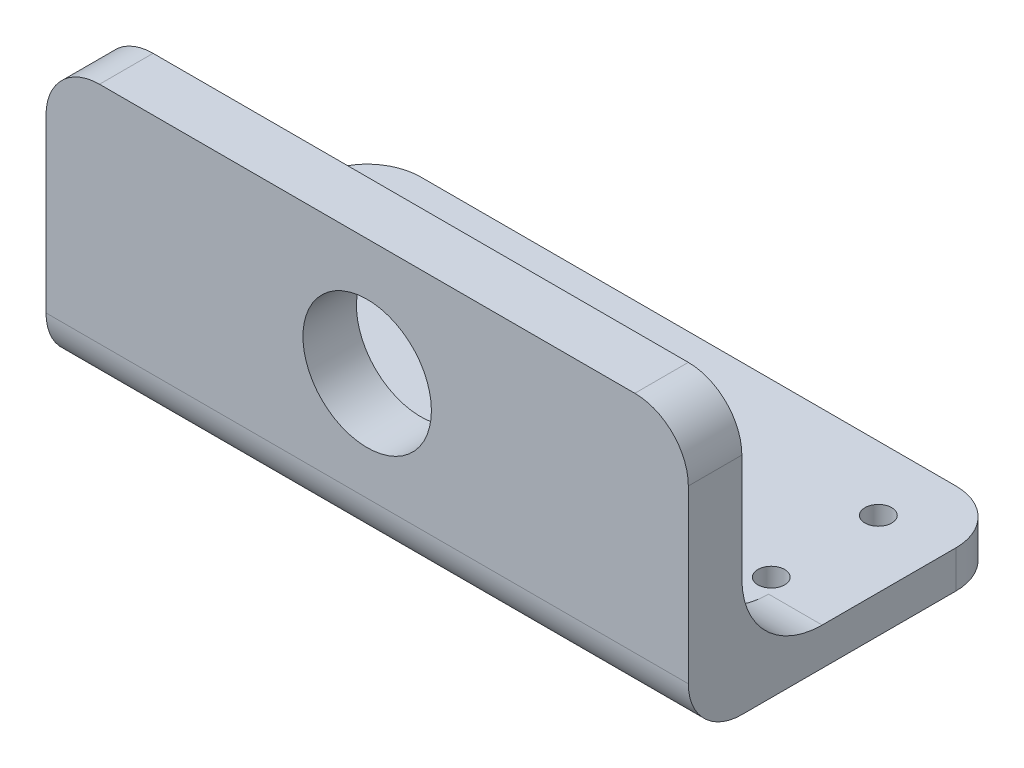
ISO-10303-21;
HEADER;
FILE_DESCRIPTION(('STEP AP214'),'2;1');
FILE_NAME('part.step','',(''),(''),'','','');
FILE_SCHEMA(('AUTOMOTIVE_DESIGN { 1 0 10303 214 1 1 1 1 }'));
ENDSEC;
DATA;
#1=APPLICATION_CONTEXT('core data for automotive mechanical design processes');
#2=APPLICATION_PROTOCOL_DEFINITION('international standard','automotive_design',2000,#1);
#3=PRODUCT_CONTEXT('',#1,'mechanical');
#4=PRODUCT('Part','Part','',(#3));
#5=PRODUCT_RELATED_PRODUCT_CATEGORY('part','',(#4));
#6=PRODUCT_DEFINITION_FORMATION('','',#4);
#7=PRODUCT_DEFINITION_CONTEXT('part definition',#1,'design');
#8=PRODUCT_DEFINITION('design','',#6,#7);
#9=PRODUCT_DEFINITION_SHAPE('','',#8);
#10=(LENGTH_UNIT() NAMED_UNIT(*) SI_UNIT(.MILLI.,.METRE.));
#11=(NAMED_UNIT(*) PLANE_ANGLE_UNIT() SI_UNIT($,.RADIAN.));
#12=(NAMED_UNIT(*) SI_UNIT($,.STERADIAN.) SOLID_ANGLE_UNIT());
#13=UNCERTAINTY_MEASURE_WITH_UNIT(LENGTH_MEASURE(1.E-05),#10,'distance_accuracy_value','');
#14=(GEOMETRIC_REPRESENTATION_CONTEXT(3) GLOBAL_UNCERTAINTY_ASSIGNED_CONTEXT((#13)) GLOBAL_UNIT_ASSIGNED_CONTEXT((#10,
#11,#12)) REPRESENTATION_CONTEXT('',''));
#15=CARTESIAN_POINT('',(0.,0.,0.));
#16=DIRECTION('',(0.,0.,1.));
#17=DIRECTION('',(1.,0.,0.));
#18=AXIS2_PLACEMENT_3D('',#15,#16,#17);
#19=CARTESIAN_POINT('',(60.,-72.,-2.5));
#20=DIRECTION('',(1.,0.,0.));
#21=DIRECTION('',(0.,0.,-1.));
#22=AXIS2_PLACEMENT_3D('',#19,#20,#21);
#23=PLANE('',#22);
#24=DIRECTION('',(0.,1.,0.));
#25=VECTOR('',#24,1.);
#26=CARTESIAN_POINT('',(60.,-72.,-2.5));
#27=LINE('',#26,#25);
#28=CARTESIAN_POINT('',(60.,-62.,-2.5));
#29=VERTEX_POINT('',#28);
#30=CARTESIAN_POINT('',(60.,-30.,-2.5));
#31=VERTEX_POINT('',#30);
#32=EDGE_CURVE('E194',#29,#31,#27,.T.);
#33=ORIENTED_EDGE('',*,*,#32,.F.);
#34=CARTESIAN_POINT('',(60.,-62.,-12.5));
#35=DIRECTION('',(1.,0.,0.));
#36=DIRECTION('',(0.,0.,-1.));
#37=AXIS2_PLACEMENT_3D('',#34,#35,#36);
#38=CIRCLE('',#37,10.);
#39=CARTESIAN_POINT('',(60.,-72.,-12.5));
#40=VERTEX_POINT('',#39);
#41=EDGE_CURVE('E64',#29,#40,#38,.T.);
#42=ORIENTED_EDGE('',*,*,#41,.T.);
#43=DIRECTION('',(0.,0.,-1.));
#44=VECTOR('',#43,1.);
#45=CARTESIAN_POINT('',(60.,-72.,-2.5));
#46=LINE('',#45,#44);
#47=CARTESIAN_POINT('',(60.,-72.,-52.5));
#48=VERTEX_POINT('',#47);
#49=EDGE_CURVE('E185',#40,#48,#46,.T.);
#50=ORIENTED_EDGE('',*,*,#49,.T.);
#51=DIRECTION('',(0.,1.,0.));
#52=VECTOR('',#51,1.);
#53=CARTESIAN_POINT('',(60.,-72.,-52.5));
#54=LINE('',#53,#52);
#55=CARTESIAN_POINT('',(60.,-65.,-52.5));
#56=VERTEX_POINT('',#55);
#57=EDGE_CURVE('E223',#48,#56,#54,.T.);
#58=ORIENTED_EDGE('',*,*,#57,.T.);
#59=DIRECTION('',(0.,0.,-1.));
#60=VECTOR('',#59,1.);
#61=CARTESIAN_POINT('',(60.,-65.,-27.5));
#62=LINE('',#61,#60);
#63=CARTESIAN_POINT('',(60.,-65.,-27.5));
#64=VERTEX_POINT('',#63);
#65=EDGE_CURVE('E280',#64,#56,#62,.T.);
#66=ORIENTED_EDGE('',*,*,#65,.F.);
#67=CARTESIAN_POINT('',(60.,-50.,-27.5));
#68=DIRECTION('',(1.,0.,0.));
#69=DIRECTION('',(0.,0.,-1.));
#70=AXIS2_PLACEMENT_3D('',#67,#68,#69);
#71=CIRCLE('',#70,15.);
#72=CARTESIAN_POINT('',(60.,-50.,-12.5));
#73=VERTEX_POINT('',#72);
#74=EDGE_CURVE('E277',#73,#64,#71,.T.);
#75=ORIENTED_EDGE('',*,*,#74,.F.);
#76=DIRECTION('',(0.,1.,0.));
#77=VECTOR('',#76,1.);
#78=CARTESIAN_POINT('',(60.,-50.,-12.5));
#79=LINE('',#78,#77);
#80=CARTESIAN_POINT('',(60.,-30.,-12.5));
#81=VERTEX_POINT('',#80);
#82=EDGE_CURVE('E177',#73,#81,#79,.T.);
#83=ORIENTED_EDGE('',*,*,#82,.T.);
#84=DIRECTION('',(0.,0.,-1.));
#85=VECTOR('',#84,1.);
#86=CARTESIAN_POINT('',(60.,-30.,-2.5));
#87=LINE('',#86,#85);
#88=EDGE_CURVE('E213',#81,#31,#87,.F.);
#89=ORIENTED_EDGE('',*,*,#88,.T.);
#90=EDGE_LOOP('',(#33,#42,#50,#58,#66,#75,#83,#89));
#91=FACE_BOUND('',#90,.T.);
#92=ADVANCED_FACE('F42',(#91),#23,.T.);
#93=CARTESIAN_POINT('',(-60.,-72.,-2.5));
#94=DIRECTION('',(0.,0.,1.));
#95=DIRECTION('',(1.,0.,0.));
#96=AXIS2_PLACEMENT_3D('',#93,#94,#95);
#97=PLANE('',#96);
#98=CARTESIAN_POINT('',(0.,-41.8,-2.5));
#99=DIRECTION('',(0.,0.,1.));
#100=DIRECTION('',(1.,0.,0.));
#101=AXIS2_PLACEMENT_3D('',#98,#99,#100);
#102=CIRCLE('',#101,12.);
#103=CARTESIAN_POINT('',(12.,-41.8,-2.5));
#104=VERTEX_POINT('',#103);
#105=EDGE_CURVE('E202',#104,#104,#102,.T.);
#106=ORIENTED_EDGE('',*,*,#105,.F.);
#107=EDGE_LOOP('',(#106));
#108=FACE_BOUND('',#107,.T.);
#109=DIRECTION('',(0.,1.,0.));
#110=VECTOR('',#109,1.);
#111=CARTESIAN_POINT('',(-60.,-72.,-2.5));
#112=LINE('',#111,#110);
#113=CARTESIAN_POINT('',(-60.,-62.,-2.5));
#114=VERTEX_POINT('',#113);
#115=CARTESIAN_POINT('',(-60.,-30.,-2.5));
#116=VERTEX_POINT('',#115);
#117=EDGE_CURVE('E193',#114,#116,#112,.T.);
#118=ORIENTED_EDGE('',*,*,#117,.F.);
#119=DIRECTION('',(1.,0.,0.));
#120=VECTOR('',#119,1.);
#121=CARTESIAN_POINT('',(60.,-62.,-2.5));
#122=LINE('',#121,#120);
#123=EDGE_CURVE('E242',#114,#29,#122,.T.);
#124=ORIENTED_EDGE('',*,*,#123,.T.);
#125=ORIENTED_EDGE('',*,*,#32,.T.);
#126=CARTESIAN_POINT('',(50.,-30.,-2.5));
#127=DIRECTION('',(0.,0.,1.));
#128=DIRECTION('',(1.,0.,0.));
#129=AXIS2_PLACEMENT_3D('',#126,#127,#128);
#130=CIRCLE('',#129,10.);
#131=CARTESIAN_POINT('',(50.,-20.,-2.5));
#132=VERTEX_POINT('',#131);
#133=EDGE_CURVE('E219',#31,#132,#130,.T.);
#134=ORIENTED_EDGE('',*,*,#133,.T.);
#135=DIRECTION('',(1.,0.,0.));
#136=VECTOR('',#135,1.);
#137=CARTESIAN_POINT('',(-60.,-20.,-2.5));
#138=LINE('',#137,#136);
#139=CARTESIAN_POINT('',(-50.,-20.,-2.5));
#140=VERTEX_POINT('',#139);
#141=EDGE_CURVE('E203',#140,#132,#138,.T.);
#142=ORIENTED_EDGE('',*,*,#141,.F.);
#143=CARTESIAN_POINT('',(-50.,-30.,-2.5));
#144=DIRECTION('',(0.,0.,1.));
#145=DIRECTION('',(1.,0.,0.));
#146=AXIS2_PLACEMENT_3D('',#143,#144,#145);
#147=CIRCLE('',#146,10.);
#148=EDGE_CURVE('E216',#140,#116,#147,.T.);
#149=ORIENTED_EDGE('',*,*,#148,.T.);
#150=EDGE_LOOP('',(#118,#124,#125,#134,#142,#149));
#151=FACE_BOUND('',#150,.T.);
#152=ADVANCED_FACE('F248',(#108,#151),#97,.T.);
#153=CARTESIAN_POINT('',(-60.,-72.,-62.5));
#154=DIRECTION('',(-1.,0.,0.));
#155=DIRECTION('',(0.,0.,1.));
#156=AXIS2_PLACEMENT_3D('',#153,#154,#155);
#157=PLANE('',#156);
#158=DIRECTION('',(0.,0.,1.));
#159=VECTOR('',#158,1.);
#160=CARTESIAN_POINT('',(-60.,-72.,-62.5));
#161=LINE('',#160,#159);
#162=CARTESIAN_POINT('',(-60.,-72.,-52.5));
#163=VERTEX_POINT('',#162);
#164=CARTESIAN_POINT('',(-60.,-72.,-12.5));
#165=VERTEX_POINT('',#164);
#166=EDGE_CURVE('E191',#163,#165,#161,.T.);
#167=ORIENTED_EDGE('',*,*,#166,.T.);
#168=CARTESIAN_POINT('',(-60.,-62.,-12.5));
#169=DIRECTION('',(-1.,0.,0.));
#170=DIRECTION('',(0.,0.,1.));
#171=AXIS2_PLACEMENT_3D('',#168,#169,#170);
#172=CIRCLE('',#171,10.);
#173=EDGE_CURVE('E11',#165,#114,#172,.T.);
#174=ORIENTED_EDGE('',*,*,#173,.T.);
#175=ORIENTED_EDGE('',*,*,#117,.T.);
#176=DIRECTION('',(0.,0.,1.));
#177=VECTOR('',#176,1.);
#178=CARTESIAN_POINT('',(-60.,-30.,-62.5));
#179=LINE('',#178,#177);
#180=CARTESIAN_POINT('',(-60.,-30.,-12.5));
#181=VERTEX_POINT('',#180);
#182=EDGE_CURVE('E221',#116,#181,#179,.F.);
#183=ORIENTED_EDGE('',*,*,#182,.T.);
#184=DIRECTION('',(0.,1.,0.));
#185=VECTOR('',#184,1.);
#186=CARTESIAN_POINT('',(-60.,-50.,-12.5));
#187=LINE('',#186,#185);
#188=CARTESIAN_POINT('',(-60.,-50.,-12.5));
#189=VERTEX_POINT('',#188);
#190=EDGE_CURVE('E174',#189,#181,#187,.T.);
#191=ORIENTED_EDGE('',*,*,#190,.F.);
#192=CARTESIAN_POINT('',(-60.,-50.,-27.5));
#193=DIRECTION('',(1.,0.,0.));
#194=DIRECTION('',(0.,0.,-1.));
#195=AXIS2_PLACEMENT_3D('',#192,#193,#194);
#196=CIRCLE('',#195,15.);
#197=CARTESIAN_POINT('',(-60.,-65.,-27.5));
#198=VERTEX_POINT('',#197);
#199=EDGE_CURVE('E173',#189,#198,#196,.T.);
#200=ORIENTED_EDGE('',*,*,#199,.T.);
#201=DIRECTION('',(0.,0.,-1.));
#202=VECTOR('',#201,1.);
#203=CARTESIAN_POINT('',(-60.,-65.,-27.5));
#204=LINE('',#203,#202);
#205=CARTESIAN_POINT('',(-60.,-65.,-52.5));
#206=VERTEX_POINT('',#205);
#207=EDGE_CURVE('E279',#198,#206,#204,.T.);
#208=ORIENTED_EDGE('',*,*,#207,.T.);
#209=DIRECTION('',(0.,1.,0.));
#210=VECTOR('',#209,1.);
#211=CARTESIAN_POINT('',(-60.,-72.,-52.5));
#212=LINE('',#211,#210);
#213=EDGE_CURVE('E240',#206,#163,#212,.F.);
#214=ORIENTED_EDGE('',*,*,#213,.T.);
#215=EDGE_LOOP('',(#167,#174,#175,#183,#191,#200,#208,#214));
#216=FACE_BOUND('',#215,.T.);
#217=ADVANCED_FACE('F309',(#216),#157,.T.);
#218=CARTESIAN_POINT('',(-60.,-50.,-12.5));
#219=DIRECTION('',(0.,0.,1.));
#220=DIRECTION('',(1.,0.,0.));
#221=AXIS2_PLACEMENT_3D('',#218,#219,#220);
#222=PLANE('',#221);
#223=CARTESIAN_POINT('',(0.,-41.8,-12.5));
#224=DIRECTION('',(0.,0.,1.));
#225=DIRECTION('',(1.,0.,0.));
#226=AXIS2_PLACEMENT_3D('',#223,#224,#225);
#227=CIRCLE('',#226,12.);
#228=CARTESIAN_POINT('',(12.,-41.8,-12.5));
#229=VERTEX_POINT('',#228);
#230=EDGE_CURVE('E199',#229,#229,#227,.T.);
#231=ORIENTED_EDGE('',*,*,#230,.T.);
#232=EDGE_LOOP('',(#231));
#233=FACE_BOUND('',#232,.T.);
#234=DIRECTION('',(-1.,0.,0.));
#235=VECTOR('',#234,1.);
#236=CARTESIAN_POINT('',(60.,-20.,-12.5));
#237=LINE('',#236,#235);
#238=CARTESIAN_POINT('',(50.,-20.,-12.5));
#239=VERTEX_POINT('',#238);
#240=CARTESIAN_POINT('',(-50.,-20.,-12.5));
#241=VERTEX_POINT('',#240);
#242=EDGE_CURVE('E264',#239,#241,#237,.T.);
#243=ORIENTED_EDGE('',*,*,#242,.F.);
#244=CARTESIAN_POINT('',(50.,-30.,-12.5));
#245=DIRECTION('',(0.,0.,1.));
#246=DIRECTION('',(1.,0.,0.));
#247=AXIS2_PLACEMENT_3D('',#244,#245,#246);
#248=CIRCLE('',#247,10.);
#249=EDGE_CURVE('E211',#239,#81,#248,.F.);
#250=ORIENTED_EDGE('',*,*,#249,.T.);
#251=ORIENTED_EDGE('',*,*,#82,.F.);
#252=DIRECTION('',(1.,0.,0.));
#253=VECTOR('',#252,1.);
#254=CARTESIAN_POINT('',(-60.,-50.,-12.5));
#255=LINE('',#254,#253);
#256=CARTESIAN_POINT('',(50.,-50.,-12.5));
#257=VERTEX_POINT('',#256);
#258=EDGE_CURVE('E175',#257,#73,#255,.T.);
#259=ORIENTED_EDGE('',*,*,#258,.F.);
#260=DIRECTION('',(0.,-1.,0.));
#261=VECTOR('',#260,1.);
#262=CARTESIAN_POINT('',(50.,-50.,-12.5));
#263=LINE('',#262,#261);
#264=CARTESIAN_POINT('',(50.,-65.,-12.5));
#265=VERTEX_POINT('',#264);
#266=EDGE_CURVE('E271',#257,#265,#263,.T.);
#267=ORIENTED_EDGE('',*,*,#266,.T.);
#268=DIRECTION('',(1.,0.,0.));
#269=VECTOR('',#268,1.);
#270=CARTESIAN_POINT('',(-50.,-65.,-12.5));
#271=LINE('',#270,#269);
#272=CARTESIAN_POINT('',(-50.,-65.,-12.5));
#273=VERTEX_POINT('',#272);
#274=EDGE_CURVE('E168',#273,#265,#271,.T.);
#275=ORIENTED_EDGE('',*,*,#274,.F.);
#276=DIRECTION('',(0.,-1.,0.));
#277=VECTOR('',#276,1.);
#278=CARTESIAN_POINT('',(-50.,-50.,-12.5));
#279=LINE('',#278,#277);
#280=CARTESIAN_POINT('',(-50.,-50.,-12.5));
#281=VERTEX_POINT('',#280);
#282=EDGE_CURVE('E151',#281,#273,#279,.T.);
#283=ORIENTED_EDGE('',*,*,#282,.F.);
#284=EDGE_CURVE('E165',#189,#281,#255,.T.);
#285=ORIENTED_EDGE('',*,*,#284,.F.);
#286=ORIENTED_EDGE('',*,*,#190,.T.);
#287=CARTESIAN_POINT('',(-50.,-30.,-12.5));
#288=DIRECTION('',(0.,0.,1.));
#289=DIRECTION('',(1.,0.,0.));
#290=AXIS2_PLACEMENT_3D('',#287,#288,#289);
#291=CIRCLE('',#290,10.);
#292=EDGE_CURVE('E209',#181,#241,#291,.F.);
#293=ORIENTED_EDGE('',*,*,#292,.T.);
#294=EDGE_LOOP('',(#243,#250,#251,#259,#267,#275,#283,#285,#286,#293));
#295=FACE_BOUND('',#294,.T.);
#296=ADVANCED_FACE('F163',(#233,#295),#222,.F.);
#297=CARTESIAN_POINT('',(-60.,-50.,-27.5));
#298=DIRECTION('',(1.,0.,0.));
#299=DIRECTION('',(0.,0.,-1.));
#300=AXIS2_PLACEMENT_3D('',#297,#298,#299);
#301=CYLINDRICAL_SURFACE('',#300,15.);
#302=CARTESIAN_POINT('',(-50.,-50.,-27.5));
#303=DIRECTION('',(1.,0.,0.));
#304=DIRECTION('',(0.,0.,-1.));
#305=AXIS2_PLACEMENT_3D('',#302,#303,#304);
#306=CIRCLE('',#305,15.);
#307=CARTESIAN_POINT('',(-50.,-65.,-27.5000000000001));
#308=VERTEX_POINT('',#307);
#309=EDGE_CURVE('E148',#308,#281,#306,.F.);
#310=ORIENTED_EDGE('',*,*,#309,.F.);
#311=DIRECTION('',(1.,0.,0.));
#312=VECTOR('',#311,1.);
#313=CARTESIAN_POINT('',(-60.,-65.,-27.5));
#314=LINE('',#313,#312);
#315=EDGE_CURVE('E182',#198,#308,#314,.T.);
#316=ORIENTED_EDGE('',*,*,#315,.F.);
#317=ORIENTED_EDGE('',*,*,#199,.F.);
#318=ORIENTED_EDGE('',*,*,#284,.T.);
#319=EDGE_LOOP('',(#310,#316,#317,#318));
#320=FACE_BOUND('',#319,.T.);
#321=ADVANCED_FACE('F171',(#320),#301,.F.);
#322=CARTESIAN_POINT('',(60.,-72.,-62.5));
#323=DIRECTION('',(0.,0.,-1.));
#324=DIRECTION('',(-1.,0.,0.));
#325=AXIS2_PLACEMENT_3D('',#322,#323,#324);
#326=PLANE('',#325);
#327=DIRECTION('',(1.,0.,0.));
#328=VECTOR('',#327,1.);
#329=CARTESIAN_POINT('',(-60.,-65.,-62.5));
#330=LINE('',#329,#328);
#331=CARTESIAN_POINT('',(-50.,-65.,-62.5));
#332=VERTEX_POINT('',#331);
#333=CARTESIAN_POINT('',(50.,-65.,-62.5));
#334=VERTEX_POINT('',#333);
#335=EDGE_CURVE('E179',#332,#334,#330,.T.);
#336=ORIENTED_EDGE('',*,*,#335,.T.);
#337=DIRECTION('',(0.,1.,0.));
#338=VECTOR('',#337,1.);
#339=CARTESIAN_POINT('',(50.,-72.,-62.5));
#340=LINE('',#339,#338);
#341=CARTESIAN_POINT('',(50.,-72.,-62.5));
#342=VERTEX_POINT('',#341);
#343=EDGE_CURVE('E233',#334,#342,#340,.F.);
#344=ORIENTED_EDGE('',*,*,#343,.T.);
#345=DIRECTION('',(-1.,0.,0.));
#346=VECTOR('',#345,1.);
#347=CARTESIAN_POINT('',(60.,-72.,-62.5));
#348=LINE('',#347,#346);
#349=CARTESIAN_POINT('',(-50.,-72.,-62.5));
#350=VERTEX_POINT('',#349);
#351=EDGE_CURVE('E188',#342,#350,#348,.T.);
#352=ORIENTED_EDGE('',*,*,#351,.T.);
#353=DIRECTION('',(0.,1.,0.));
#354=VECTOR('',#353,1.);
#355=CARTESIAN_POINT('',(-50.,-72.,-62.5));
#356=LINE('',#355,#354);
#357=EDGE_CURVE('E230',#350,#332,#356,.T.);
#358=ORIENTED_EDGE('',*,*,#357,.T.);
#359=EDGE_LOOP('',(#336,#344,#352,#358));
#360=FACE_BOUND('',#359,.T.);
#361=ADVANCED_FACE('F314',(#360),#326,.T.);
#362=CARTESIAN_POINT('',(0.,-72.,0.));
#363=DIRECTION('',(0.,1.,0.));
#364=DIRECTION('',(0.,0.,1.));
#365=AXIS2_PLACEMENT_3D('',#362,#363,#364);
#366=PLANE('',#365);
#367=CARTESIAN_POINT('',(47.5,-72.,-30.5));
#368=DIRECTION('',(0.,1.,0.));
#369=DIRECTION('',(0.,0.,1.));
#370=AXIS2_PLACEMENT_3D('',#367,#368,#369);
#371=CIRCLE('',#370,2.5);
#372=CARTESIAN_POINT('',(47.5,-72.,-28.));
#373=VERTEX_POINT('',#372);
#374=EDGE_CURVE('E266',#373,#373,#371,.T.);
#375=ORIENTED_EDGE('',*,*,#374,.T.);
#376=EDGE_LOOP('',(#375));
#377=FACE_BOUND('',#376,.T.);
#378=CARTESIAN_POINT('',(-47.5,-72.,-50.5));
#379=DIRECTION('',(0.,1.,0.));
#380=DIRECTION('',(0.,0.,1.));
#381=AXIS2_PLACEMENT_3D('',#378,#379,#380);
#382=CIRCLE('',#381,2.5);
#383=CARTESIAN_POINT('',(-47.5,-72.,-48.));
#384=VERTEX_POINT('',#383);
#385=EDGE_CURVE('E564',#384,#384,#382,.T.);
#386=ORIENTED_EDGE('',*,*,#385,.T.);
#387=EDGE_LOOP('',(#386));
#388=FACE_BOUND('',#387,.T.);
#389=CARTESIAN_POINT('',(-47.5,-72.,-30.5));
#390=DIRECTION('',(0.,1.,0.));
#391=DIRECTION('',(0.,0.,1.));
#392=AXIS2_PLACEMENT_3D('',#389,#390,#391);
#393=CIRCLE('',#392,2.5);
#394=CARTESIAN_POINT('',(-47.5,-72.,-28.));
#395=VERTEX_POINT('',#394);
#396=EDGE_CURVE('E566',#395,#395,#393,.T.);
#397=ORIENTED_EDGE('',*,*,#396,.T.);
#398=EDGE_LOOP('',(#397));
#399=FACE_BOUND('',#398,.T.);
#400=CARTESIAN_POINT('',(47.5,-72.,-50.5));
#401=DIRECTION('',(0.,1.,0.));
#402=DIRECTION('',(0.,0.,1.));
#403=AXIS2_PLACEMENT_3D('',#400,#401,#402);
#404=CIRCLE('',#403,2.5);
#405=CARTESIAN_POINT('',(47.5,-72.,-48.));
#406=VERTEX_POINT('',#405);
#407=EDGE_CURVE('E571',#406,#406,#404,.T.);
#408=ORIENTED_EDGE('',*,*,#407,.T.);
#409=EDGE_LOOP('',(#408));
#410=FACE_BOUND('',#409,.T.);
#411=ORIENTED_EDGE('',*,*,#49,.F.);
#412=DIRECTION('',(1.,0.,0.));
#413=VECTOR('',#412,1.);
#414=CARTESIAN_POINT('',(-60.,-72.,-12.5));
#415=LINE('',#414,#413);
#416=EDGE_CURVE('E50',#40,#165,#415,.F.);
#417=ORIENTED_EDGE('',*,*,#416,.T.);
#418=ORIENTED_EDGE('',*,*,#166,.F.);
#419=CARTESIAN_POINT('',(-50.,-72.,-52.5));
#420=DIRECTION('',(0.,1.,0.));
#421=DIRECTION('',(0.,0.,1.));
#422=AXIS2_PLACEMENT_3D('',#419,#420,#421);
#423=CIRCLE('',#422,10.);
#424=EDGE_CURVE('E235',#163,#350,#423,.F.);
#425=ORIENTED_EDGE('',*,*,#424,.T.);
#426=ORIENTED_EDGE('',*,*,#351,.F.);
#427=CARTESIAN_POINT('',(50.,-72.,-52.5));
#428=DIRECTION('',(0.,1.,0.));
#429=DIRECTION('',(0.,0.,1.));
#430=AXIS2_PLACEMENT_3D('',#427,#428,#429);
#431=CIRCLE('',#430,10.);
#432=EDGE_CURVE('E237',#342,#48,#431,.F.);
#433=ORIENTED_EDGE('',*,*,#432,.T.);
#434=EDGE_LOOP('',(#411,#417,#418,#425,#426,#433));
#435=FACE_BOUND('',#434,.T.);
#436=ADVANCED_FACE('F313',(#377,#388,#399,#410,#435),#366,.F.);
#437=CARTESIAN_POINT('',(50.,-65.,-27.5));
#438=VERTEX_POINT('',#437);
#439=EDGE_CURVE('E283',#438,#64,#314,.T.);
#440=ORIENTED_EDGE('',*,*,#439,.F.);
#441=CARTESIAN_POINT('',(50.,-50.,-27.5));
#442=DIRECTION('',(1.,0.,0.));
#443=DIRECTION('',(0.,0.,-1.));
#444=AXIS2_PLACEMENT_3D('',#441,#442,#443);
#445=CIRCLE('',#444,15.);
#446=EDGE_CURVE('E158',#438,#257,#445,.F.);
#447=ORIENTED_EDGE('',*,*,#446,.T.);
#448=ORIENTED_EDGE('',*,*,#258,.T.);
#449=ORIENTED_EDGE('',*,*,#74,.T.);
#450=EDGE_LOOP('',(#440,#447,#448,#449));
#451=FACE_BOUND('',#450,.T.);
#452=ADVANCED_FACE('F299',(#451),#301,.F.);
#453=CARTESIAN_POINT('',(-60.,-65.,-27.5));
#454=DIRECTION('',(0.,-1.,0.));
#455=DIRECTION('',(0.,0.,-1.));
#456=AXIS2_PLACEMENT_3D('',#453,#454,#455);
#457=PLANE('',#456);
#458=CARTESIAN_POINT('',(47.5,-65.,-30.5));
#459=DIRECTION('',(0.,1.,0.));
#460=DIRECTION('',(0.,0.,1.));
#461=AXIS2_PLACEMENT_3D('',#458,#459,#460);
#462=CIRCLE('',#461,2.5);
#463=CARTESIAN_POINT('',(47.5,-65.,-28.));
#464=VERTEX_POINT('',#463);
#465=EDGE_CURVE('E561',#464,#464,#462,.T.);
#466=ORIENTED_EDGE('',*,*,#465,.F.);
#467=EDGE_LOOP('',(#466));
#468=FACE_BOUND('',#467,.T.);
#469=CARTESIAN_POINT('',(-47.5,-65.,-50.5));
#470=DIRECTION('',(0.,1.,0.));
#471=DIRECTION('',(0.,0.,-1.));
#472=AXIS2_PLACEMENT_3D('',#469,#470,#471);
#473=CIRCLE('',#472,2.5);
#474=CARTESIAN_POINT('',(-47.5,-65.,-53.));
#475=VERTEX_POINT('',#474);
#476=EDGE_CURVE('E577',#475,#475,#473,.T.);
#477=ORIENTED_EDGE('',*,*,#476,.F.);
#478=EDGE_LOOP('',(#477));
#479=FACE_BOUND('',#478,.T.);
#480=CARTESIAN_POINT('',(-47.5,-65.,-30.5));
#481=DIRECTION('',(0.,1.,0.));
#482=DIRECTION('',(0.,0.,-1.));
#483=AXIS2_PLACEMENT_3D('',#480,#481,#482);
#484=CIRCLE('',#483,2.5);
#485=CARTESIAN_POINT('',(-47.5,-65.,-33.));
#486=VERTEX_POINT('',#485);
#487=EDGE_CURVE('E580',#486,#486,#484,.T.);
#488=ORIENTED_EDGE('',*,*,#487,.F.);
#489=EDGE_LOOP('',(#488));
#490=FACE_BOUND('',#489,.T.);
#491=CARTESIAN_POINT('',(47.5,-65.,-50.5));
#492=DIRECTION('',(0.,1.,0.));
#493=DIRECTION('',(0.,0.,1.));
#494=AXIS2_PLACEMENT_3D('',#491,#492,#493);
#495=CIRCLE('',#494,2.5);
#496=CARTESIAN_POINT('',(47.5,-65.,-48.));
#497=VERTEX_POINT('',#496);
#498=EDGE_CURVE('E574',#497,#497,#495,.T.);
#499=ORIENTED_EDGE('',*,*,#498,.F.);
#500=EDGE_LOOP('',(#499));
#501=FACE_BOUND('',#500,.T.);
#502=ORIENTED_EDGE('',*,*,#65,.T.);
#503=CARTESIAN_POINT('',(50.,-65.,-52.5));
#504=DIRECTION('',(0.,-1.,0.));
#505=DIRECTION('',(0.,0.,-1.));
#506=AXIS2_PLACEMENT_3D('',#503,#504,#505);
#507=CIRCLE('',#506,10.);
#508=EDGE_CURVE('E228',#56,#334,#507,.F.);
#509=ORIENTED_EDGE('',*,*,#508,.T.);
#510=ORIENTED_EDGE('',*,*,#335,.F.);
#511=CARTESIAN_POINT('',(-50.,-65.,-52.5));
#512=DIRECTION('',(0.,-1.,0.));
#513=DIRECTION('',(0.,0.,-1.));
#514=AXIS2_PLACEMENT_3D('',#511,#512,#513);
#515=CIRCLE('',#514,10.);
#516=EDGE_CURVE('E226',#332,#206,#515,.F.);
#517=ORIENTED_EDGE('',*,*,#516,.T.);
#518=ORIENTED_EDGE('',*,*,#207,.F.);
#519=ORIENTED_EDGE('',*,*,#315,.T.);
#520=DIRECTION('',(0.,0.,-1.));
#521=VECTOR('',#520,1.);
#522=CARTESIAN_POINT('',(-50.,-65.,-12.5));
#523=LINE('',#522,#521);
#524=EDGE_CURVE('E153',#273,#308,#523,.T.);
#525=ORIENTED_EDGE('',*,*,#524,.F.);
#526=ORIENTED_EDGE('',*,*,#274,.T.);
#527=DIRECTION('',(0.,0.,-1.));
#528=VECTOR('',#527,1.);
#529=CARTESIAN_POINT('',(50.,-65.,-12.5));
#530=LINE('',#529,#528);
#531=EDGE_CURVE('E169',#265,#438,#530,.T.);
#532=ORIENTED_EDGE('',*,*,#531,.T.);
#533=ORIENTED_EDGE('',*,*,#439,.T.);
#534=EDGE_LOOP('',(#502,#509,#510,#517,#518,#519,#525,#526,#532,#533));
#535=FACE_BOUND('',#534,.T.);
#536=ADVANCED_FACE('F294',(#468,#479,#490,#501,#535),#457,.F.);
#537=CARTESIAN_POINT('',(-50.,0.,0.));
#538=DIRECTION('',(1.,0.,0.));
#539=DIRECTION('',(0.,0.,-1.));
#540=AXIS2_PLACEMENT_3D('',#537,#538,#539);
#541=PLANE('',#540);
#542=ORIENTED_EDGE('',*,*,#309,.T.);
#543=ORIENTED_EDGE('',*,*,#282,.T.);
#544=ORIENTED_EDGE('',*,*,#524,.T.);
#545=EDGE_LOOP('',(#542,#543,#544));
#546=FACE_BOUND('',#545,.T.);
#547=ADVANCED_FACE('F150',(#546),#541,.T.);
#548=CARTESIAN_POINT('',(50.,0.,0.));
#549=DIRECTION('',(1.,0.,0.));
#550=DIRECTION('',(0.,0.,-1.));
#551=AXIS2_PLACEMENT_3D('',#548,#549,#550);
#552=PLANE('',#551);
#553=ORIENTED_EDGE('',*,*,#531,.F.);
#554=ORIENTED_EDGE('',*,*,#266,.F.);
#555=ORIENTED_EDGE('',*,*,#446,.F.);
#556=EDGE_LOOP('',(#553,#554,#555));
#557=FACE_BOUND('',#556,.T.);
#558=ADVANCED_FACE('F356',(#557),#552,.F.);
#559=CARTESIAN_POINT('',(0.,-41.8,37.5));
#560=DIRECTION('',(0.,0.,-1.));
#561=DIRECTION('',(-1.,0.,0.));
#562=AXIS2_PLACEMENT_3D('',#559,#560,#561);
#563=CYLINDRICAL_SURFACE('',#562,12.);
#564=ORIENTED_EDGE('',*,*,#105,.T.);
#565=EDGE_LOOP('',(#564));
#566=FACE_BOUND('',#565,.T.);
#567=ORIENTED_EDGE('',*,*,#230,.F.);
#568=EDGE_LOOP('',(#567));
#569=FACE_BOUND('',#568,.T.);
#570=ADVANCED_FACE('F358',(#566,#569),#563,.F.);
#571=CARTESIAN_POINT('',(0.,-20.,0.));
#572=DIRECTION('',(0.,1.,0.));
#573=DIRECTION('',(0.,0.,1.));
#574=AXIS2_PLACEMENT_3D('',#571,#572,#573);
#575=PLANE('',#574);
#576=ORIENTED_EDGE('',*,*,#141,.T.);
#577=DIRECTION('',(0.,0.,-1.));
#578=VECTOR('',#577,1.);
#579=CARTESIAN_POINT('',(50.,-20.,0.));
#580=LINE('',#579,#578);
#581=EDGE_CURVE('E206',#132,#239,#580,.T.);
#582=ORIENTED_EDGE('',*,*,#581,.T.);
#583=ORIENTED_EDGE('',*,*,#242,.T.);
#584=DIRECTION('',(0.,0.,1.));
#585=VECTOR('',#584,1.);
#586=CARTESIAN_POINT('',(-50.,-20.,0.));
#587=LINE('',#586,#585);
#588=EDGE_CURVE('E157',#241,#140,#587,.T.);
#589=ORIENTED_EDGE('',*,*,#588,.T.);
#590=EDGE_LOOP('',(#576,#582,#583,#589));
#591=FACE_BOUND('',#590,.T.);
#592=ADVANCED_FACE('F261',(#591),#575,.T.);
#593=CARTESIAN_POINT('',(50.,-30.,0.));
#594=DIRECTION('',(0.,0.,-1.));
#595=DIRECTION('',(-1.,0.,0.));
#596=AXIS2_PLACEMENT_3D('',#593,#594,#595);
#597=CYLINDRICAL_SURFACE('',#596,10.);
#598=ORIENTED_EDGE('',*,*,#133,.F.);
#599=ORIENTED_EDGE('',*,*,#88,.F.);
#600=ORIENTED_EDGE('',*,*,#249,.F.);
#601=ORIENTED_EDGE('',*,*,#581,.F.);
#602=EDGE_LOOP('',(#598,#599,#600,#601));
#603=FACE_BOUND('',#602,.T.);
#604=ADVANCED_FACE('F257',(#603),#597,.T.);
#605=CARTESIAN_POINT('',(-50.,-30.,0.));
#606=DIRECTION('',(0.,0.,1.));
#607=DIRECTION('',(1.,0.,0.));
#608=AXIS2_PLACEMENT_3D('',#605,#606,#607);
#609=CYLINDRICAL_SURFACE('',#608,10.);
#610=ORIENTED_EDGE('',*,*,#292,.F.);
#611=ORIENTED_EDGE('',*,*,#182,.F.);
#612=ORIENTED_EDGE('',*,*,#148,.F.);
#613=ORIENTED_EDGE('',*,*,#588,.F.);
#614=EDGE_LOOP('',(#610,#611,#612,#613));
#615=FACE_BOUND('',#614,.T.);
#616=ADVANCED_FACE('F338',(#615),#609,.T.);
#617=CARTESIAN_POINT('',(50.,-72.,-52.5));
#618=DIRECTION('',(0.,1.,0.));
#619=DIRECTION('',(0.,0.,1.));
#620=AXIS2_PLACEMENT_3D('',#617,#618,#619);
#621=CYLINDRICAL_SURFACE('',#620,10.);
#622=ORIENTED_EDGE('',*,*,#432,.F.);
#623=ORIENTED_EDGE('',*,*,#343,.F.);
#624=ORIENTED_EDGE('',*,*,#508,.F.);
#625=ORIENTED_EDGE('',*,*,#57,.F.);
#626=EDGE_LOOP('',(#622,#623,#624,#625));
#627=FACE_BOUND('',#626,.T.);
#628=ADVANCED_FACE('F304',(#627),#621,.T.);
#629=CARTESIAN_POINT('',(-50.,-72.,-52.5));
#630=DIRECTION('',(0.,1.,0.));
#631=DIRECTION('',(0.,0.,1.));
#632=AXIS2_PLACEMENT_3D('',#629,#630,#631);
#633=CYLINDRICAL_SURFACE('',#632,10.);
#634=ORIENTED_EDGE('',*,*,#424,.F.);
#635=ORIENTED_EDGE('',*,*,#213,.F.);
#636=ORIENTED_EDGE('',*,*,#516,.F.);
#637=ORIENTED_EDGE('',*,*,#357,.F.);
#638=EDGE_LOOP('',(#634,#635,#636,#637));
#639=FACE_BOUND('',#638,.T.);
#640=ADVANCED_FACE('F311',(#639),#633,.T.);
#641=CARTESIAN_POINT('',(-60.,-62.,-12.5));
#642=DIRECTION('',(-1.,0.,0.));
#643=DIRECTION('',(0.,0.,1.));
#644=AXIS2_PLACEMENT_3D('',#641,#642,#643);
#645=CYLINDRICAL_SURFACE('',#644,10.);
#646=ORIENTED_EDGE('',*,*,#173,.F.);
#647=ORIENTED_EDGE('',*,*,#416,.F.);
#648=ORIENTED_EDGE('',*,*,#41,.F.);
#649=ORIENTED_EDGE('',*,*,#123,.F.);
#650=EDGE_LOOP('',(#646,#647,#648,#649));
#651=FACE_BOUND('',#650,.T.);
#652=ADVANCED_FACE('F44',(#651),#645,.T.);
#653=CARTESIAN_POINT('',(47.5,-75.,-50.5));
#654=DIRECTION('',(0.,1.,0.));
#655=DIRECTION('',(0.,0.,1.));
#656=AXIS2_PLACEMENT_3D('',#653,#654,#655);
#657=CYLINDRICAL_SURFACE('',#656,2.5);
#658=ORIENTED_EDGE('',*,*,#498,.T.);
#659=EDGE_LOOP('',(#658));
#660=FACE_BOUND('',#659,.T.);
#661=ORIENTED_EDGE('',*,*,#407,.F.);
#662=EDGE_LOOP('',(#661));
#663=FACE_BOUND('',#662,.T.);
#664=ADVANCED_FACE('F346',(#660,#663),#657,.F.);
#665=CARTESIAN_POINT('',(-47.5,-75.,-30.5));
#666=DIRECTION('',(0.,1.,0.));
#667=DIRECTION('',(0.,0.,1.));
#668=AXIS2_PLACEMENT_3D('',#665,#666,#667);
#669=CYLINDRICAL_SURFACE('',#668,2.5);
#670=ORIENTED_EDGE('',*,*,#487,.T.);
#671=EDGE_LOOP('',(#670));
#672=FACE_BOUND('',#671,.T.);
#673=ORIENTED_EDGE('',*,*,#396,.F.);
#674=EDGE_LOOP('',(#673));
#675=FACE_BOUND('',#674,.T.);
#676=ADVANCED_FACE('F350',(#672,#675),#669,.F.);
#677=CARTESIAN_POINT('',(-47.5,-75.,-50.5));
#678=DIRECTION('',(0.,1.,0.));
#679=DIRECTION('',(0.,0.,1.));
#680=AXIS2_PLACEMENT_3D('',#677,#678,#679);
#681=CYLINDRICAL_SURFACE('',#680,2.5);
#682=ORIENTED_EDGE('',*,*,#476,.T.);
#683=EDGE_LOOP('',(#682));
#684=FACE_BOUND('',#683,.T.);
#685=ORIENTED_EDGE('',*,*,#385,.F.);
#686=EDGE_LOOP('',(#685));
#687=FACE_BOUND('',#686,.T.);
#688=ADVANCED_FACE('F408',(#684,#687),#681,.F.);
#689=CARTESIAN_POINT('',(47.5,-75.,-30.5));
#690=DIRECTION('',(0.,1.,0.));
#691=DIRECTION('',(0.,0.,1.));
#692=AXIS2_PLACEMENT_3D('',#689,#690,#691);
#693=CYLINDRICAL_SURFACE('',#692,2.5);
#694=ORIENTED_EDGE('',*,*,#465,.T.);
#695=EDGE_LOOP('',(#694));
#696=FACE_BOUND('',#695,.T.);
#697=ORIENTED_EDGE('',*,*,#374,.F.);
#698=EDGE_LOOP('',(#697));
#699=FACE_BOUND('',#698,.T.);
#700=ADVANCED_FACE('F419',(#696,#699),#693,.F.);
#701=CLOSED_SHELL('',(#92,#152,#217,#296,#321,#361,#436,#452,#536,#547,#558,#570,#592,#604,#616,
#628,#640,#652,#664,#676,#688,#700));
#702=MANIFOLD_SOLID_BREP('B2',#701);
#703=ADVANCED_BREP_SHAPE_REPRESENTATION('',(#18,#702),#14);
#704=SHAPE_DEFINITION_REPRESENTATION(#9,#703);
ENDSEC;
END-ISO-10303-21;
